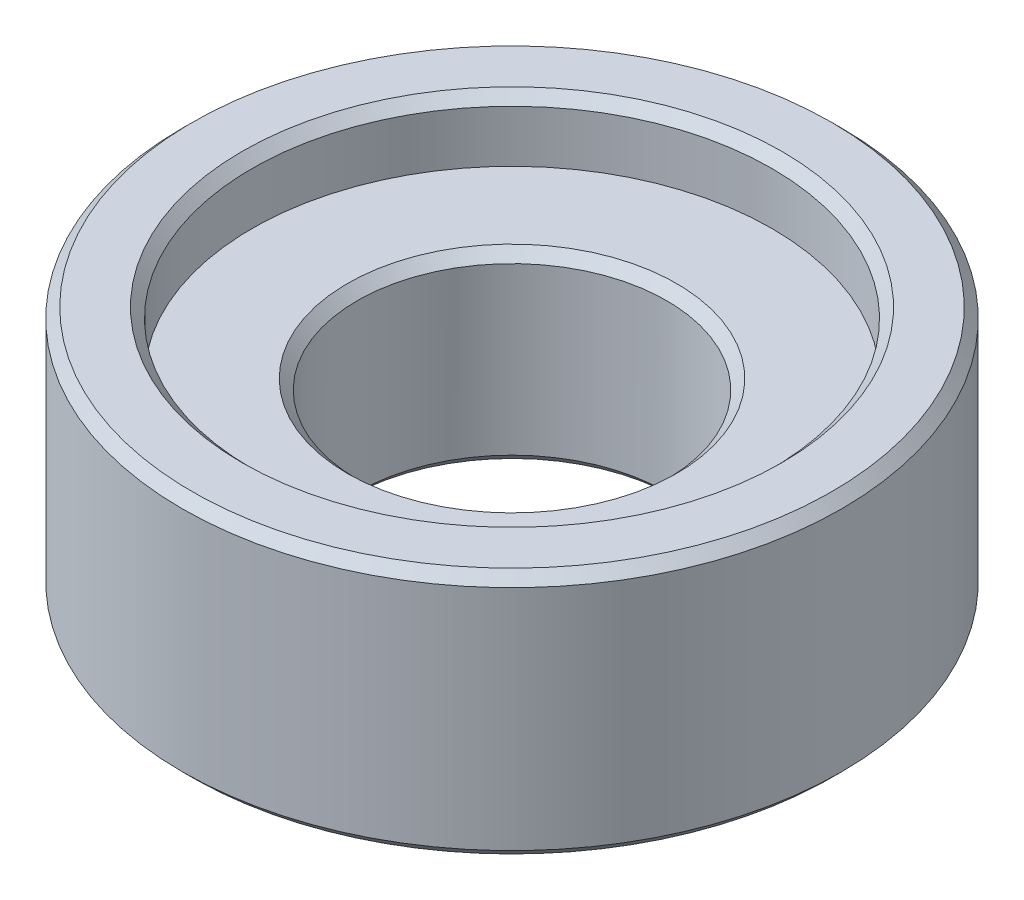
ISO-10303-21;
HEADER;
FILE_DESCRIPTION(('STEP AP214'),'2;1');
FILE_NAME('part.step','',(''),(''),'','','');
FILE_SCHEMA(('AUTOMOTIVE_DESIGN { 1 0 10303 214 1 1 1 1 }'));
ENDSEC;
DATA;
#1=APPLICATION_CONTEXT('core data for automotive mechanical design processes');
#2=APPLICATION_PROTOCOL_DEFINITION('international standard','automotive_design',2000,#1);
#3=PRODUCT_CONTEXT('',#1,'mechanical');
#4=PRODUCT('Part','Part','',(#3));
#5=PRODUCT_RELATED_PRODUCT_CATEGORY('part','',(#4));
#6=PRODUCT_DEFINITION_FORMATION('','',#4);
#7=PRODUCT_DEFINITION_CONTEXT('part definition',#1,'design');
#8=PRODUCT_DEFINITION('design','',#6,#7);
#9=PRODUCT_DEFINITION_SHAPE('','',#8);
#10=(LENGTH_UNIT() NAMED_UNIT(*) SI_UNIT(.MILLI.,.METRE.));
#11=(NAMED_UNIT(*) PLANE_ANGLE_UNIT() SI_UNIT($,.RADIAN.));
#12=(NAMED_UNIT(*) SI_UNIT($,.STERADIAN.) SOLID_ANGLE_UNIT());
#13=UNCERTAINTY_MEASURE_WITH_UNIT(LENGTH_MEASURE(1.E-05),#10,'distance_accuracy_value','');
#14=(GEOMETRIC_REPRESENTATION_CONTEXT(3) GLOBAL_UNCERTAINTY_ASSIGNED_CONTEXT((#13)) GLOBAL_UNIT_ASSIGNED_CONTEXT((#10,
#11,#12)) REPRESENTATION_CONTEXT('',''));
#15=CARTESIAN_POINT('',(0.,0.,0.));
#16=DIRECTION('',(0.,0.,1.));
#17=DIRECTION('',(1.,0.,0.));
#18=AXIS2_PLACEMENT_3D('',#15,#16,#17);
#19=CARTESIAN_POINT('',(0.,12.7,0.));
#20=DIRECTION('',(0.,1.,0.));
#21=DIRECTION('',(0.,0.,1.));
#22=AXIS2_PLACEMENT_3D('',#19,#20,#21);
#23=CONICAL_SURFACE('',#22,13.843,0.785398163397302);
#24=CARTESIAN_POINT('',(0.,12.192,0.));
#25=DIRECTION('',(0.,1.,0.));
#26=DIRECTION('',(0.,0.,1.));
#27=AXIS2_PLACEMENT_3D('',#24,#25,#26);
#28=CIRCLE('',#27,13.335);
#29=CARTESIAN_POINT('',(0.,12.192,13.335));
#30=VERTEX_POINT('',#29);
#31=EDGE_CURVE('E35',#30,#30,#28,.F.);
#32=ORIENTED_EDGE('',*,*,#31,.T.);
#33=EDGE_LOOP('',(#32));
#34=FACE_BOUND('',#33,.T.);
#35=CARTESIAN_POINT('',(0.,12.7,0.));
#36=DIRECTION('',(0.,1.,0.));
#37=DIRECTION('',(0.,0.,1.));
#38=AXIS2_PLACEMENT_3D('',#35,#36,#37);
#39=CIRCLE('',#38,13.843);
#40=CARTESIAN_POINT('',(0.,12.7,13.843));
#41=VERTEX_POINT('',#40);
#42=EDGE_CURVE('E20',#41,#41,#39,.F.);
#43=ORIENTED_EDGE('',*,*,#42,.F.);
#44=EDGE_LOOP('',(#43));
#45=FACE_BOUND('',#44,.T.);
#46=ADVANCED_FACE('F17',(#34,#45),#23,.F.);
#47=CARTESIAN_POINT('',(0.,12.7,0.));
#48=DIRECTION('',(0.,1.,0.));
#49=DIRECTION('',(0.,0.,1.));
#50=AXIS2_PLACEMENT_3D('',#47,#48,#49);
#51=CYLINDRICAL_SURFACE('',#50,13.335);
#52=CARTESIAN_POINT('',(0.,9.525,0.));
#53=DIRECTION('',(0.,1.,0.));
#54=DIRECTION('',(0.,0.,1.));
#55=AXIS2_PLACEMENT_3D('',#52,#53,#54);
#56=CIRCLE('',#55,13.335);
#57=CARTESIAN_POINT('',(0.,9.525,13.335));
#58=VERTEX_POINT('',#57);
#59=EDGE_CURVE('E52',#58,#58,#56,.T.);
#60=ORIENTED_EDGE('',*,*,#59,.F.);
#61=EDGE_LOOP('',(#60));
#62=FACE_BOUND('',#61,.T.);
#63=ORIENTED_EDGE('',*,*,#31,.F.);
#64=EDGE_LOOP('',(#63));
#65=FACE_BOUND('',#64,.T.);
#66=ADVANCED_FACE('F121',(#62,#65),#51,.F.);
#67=CARTESIAN_POINT('',(0.,12.7,0.));
#68=DIRECTION('',(0.,1.,0.));
#69=DIRECTION('',(0.,0.,1.));
#70=AXIS2_PLACEMENT_3D('',#67,#68,#69);
#71=PLANE('',#70);
#72=ORIENTED_EDGE('',*,*,#42,.T.);
#73=EDGE_LOOP('',(#72));
#74=FACE_BOUND('',#73,.T.);
#75=CARTESIAN_POINT('',(0.,12.7,0.));
#76=DIRECTION('',(0.,-1.,0.));
#77=DIRECTION('',(0.,0.,-1.));
#78=AXIS2_PLACEMENT_3D('',#75,#76,#77);
#79=CIRCLE('',#78,16.4084);
#80=CARTESIAN_POINT('',(0.,12.7,-16.4084));
#81=VERTEX_POINT('',#80);
#82=EDGE_CURVE('E47',#81,#81,#79,.T.);
#83=ORIENTED_EDGE('',*,*,#82,.F.);
#84=EDGE_LOOP('',(#83));
#85=FACE_BOUND('',#84,.T.);
#86=ADVANCED_FACE('F119',(#74,#85),#71,.T.);
#87=CARTESIAN_POINT('',(0.,9.525,0.));
#88=DIRECTION('',(0.,1.,0.));
#89=DIRECTION('',(0.,0.,1.));
#90=AXIS2_PLACEMENT_3D('',#87,#88,#89);
#91=PLANE('',#90);
#92=CARTESIAN_POINT('',(0.,9.52500000000004,0.));
#93=DIRECTION('',(0.,1.,0.));
#94=DIRECTION('',(0.,0.,1.));
#95=AXIS2_PLACEMENT_3D('',#92,#93,#94);
#96=CIRCLE('',#95,8.44549999999996);
#97=CARTESIAN_POINT('',(0.,9.52500000000004,8.44549999999996));
#98=VERTEX_POINT('',#97);
#99=EDGE_CURVE('E51',#98,#98,#96,.F.);
#100=ORIENTED_EDGE('',*,*,#99,.T.);
#101=EDGE_LOOP('',(#100));
#102=FACE_BOUND('',#101,.T.);
#103=ORIENTED_EDGE('',*,*,#59,.T.);
#104=EDGE_LOOP('',(#103));
#105=FACE_BOUND('',#104,.T.);
#106=ADVANCED_FACE('F79',(#102,#105),#91,.T.);
#107=CARTESIAN_POINT('',(0.,12.192,0.));
#108=DIRECTION('',(0.,-1.,0.));
#109=DIRECTION('',(0.,0.,-1.));
#110=AXIS2_PLACEMENT_3D('',#107,#108,#109);
#111=CONICAL_SURFACE('',#110,16.9164,0.785398163397302);
#112=CARTESIAN_POINT('',(0.,12.192,0.));
#113=DIRECTION('',(0.,1.,0.));
#114=DIRECTION('',(0.,0.,1.));
#115=AXIS2_PLACEMENT_3D('',#112,#113,#114);
#116=CIRCLE('',#115,16.9164);
#117=CARTESIAN_POINT('',(0.,12.192,16.9164));
#118=VERTEX_POINT('',#117);
#119=EDGE_CURVE('E70',#118,#118,#116,.F.);
#120=ORIENTED_EDGE('',*,*,#119,.F.);
#121=EDGE_LOOP('',(#120));
#122=FACE_BOUND('',#121,.T.);
#123=ORIENTED_EDGE('',*,*,#82,.T.);
#124=EDGE_LOOP('',(#123));
#125=FACE_BOUND('',#124,.T.);
#126=ADVANCED_FACE('F86',(#122,#125),#111,.T.);
#127=CARTESIAN_POINT('',(0.,9.52500000000004,0.));
#128=DIRECTION('',(0.,1.,0.));
#129=DIRECTION('',(0.,0.,1.));
#130=AXIS2_PLACEMENT_3D('',#127,#128,#129);
#131=CONICAL_SURFACE('',#130,8.44549999999996,0.7853981633973);
#132=ORIENTED_EDGE('',*,*,#99,.F.);
#133=EDGE_LOOP('',(#132));
#134=FACE_BOUND('',#133,.T.);
#135=CARTESIAN_POINT('',(0.,9.017,0.));
#136=DIRECTION('',(0.,1.,0.));
#137=DIRECTION('',(0.,0.,1.));
#138=AXIS2_PLACEMENT_3D('',#135,#136,#137);
#139=CIRCLE('',#138,7.9375);
#140=CARTESIAN_POINT('',(0.,9.017,7.9375));
#141=VERTEX_POINT('',#140);
#142=EDGE_CURVE('E67',#141,#141,#139,.F.);
#143=ORIENTED_EDGE('',*,*,#142,.T.);
#144=EDGE_LOOP('',(#143));
#145=FACE_BOUND('',#144,.T.);
#146=ADVANCED_FACE('F82',(#134,#145),#131,.F.);
#147=CARTESIAN_POINT('',(0.,0.,0.));
#148=DIRECTION('',(0.,1.,0.));
#149=DIRECTION('',(0.,0.,1.));
#150=AXIS2_PLACEMENT_3D('',#147,#148,#149);
#151=CYLINDRICAL_SURFACE('',#150,16.9164);
#152=CARTESIAN_POINT('',(0.,0.507999999956946,0.));
#153=DIRECTION('',(0.,1.,0.));
#154=DIRECTION('',(0.,0.,-1.));
#155=AXIS2_PLACEMENT_3D('',#152,#153,#154);
#156=CIRCLE('',#155,16.9163999999575);
#157=CARTESIAN_POINT('',(0.,0.507999999956945,-16.9163999999575));
#158=VERTEX_POINT('',#157);
#159=EDGE_CURVE('E62',#158,#158,#156,.F.);
#160=ORIENTED_EDGE('',*,*,#159,.F.);
#161=EDGE_LOOP('',(#160));
#162=FACE_BOUND('',#161,.T.);
#163=ORIENTED_EDGE('',*,*,#119,.T.);
#164=EDGE_LOOP('',(#163));
#165=FACE_BOUND('',#164,.T.);
#166=ADVANCED_FACE('F85',(#162,#165),#151,.T.);
#167=CARTESIAN_POINT('',(0.,0.,0.));
#168=DIRECTION('',(0.,1.,0.));
#169=DIRECTION('',(0.,0.,1.));
#170=AXIS2_PLACEMENT_3D('',#167,#168,#169);
#171=CYLINDRICAL_SURFACE('',#170,7.9375);
#172=ORIENTED_EDGE('',*,*,#142,.F.);
#173=EDGE_LOOP('',(#172));
#174=FACE_BOUND('',#173,.T.);
#175=CARTESIAN_POINT('',(0.,0.508000000000418,0.));
#176=DIRECTION('',(0.,-1.,0.));
#177=DIRECTION('',(0.,0.,-1.));
#178=AXIS2_PLACEMENT_3D('',#175,#176,#177);
#179=CIRCLE('',#178,7.93750000000042);
#180=CARTESIAN_POINT('',(0.,0.508000000000418,-7.93750000000042));
#181=VERTEX_POINT('',#180);
#182=EDGE_CURVE('E31',#181,#181,#179,.T.);
#183=ORIENTED_EDGE('',*,*,#182,.T.);
#184=EDGE_LOOP('',(#183));
#185=FACE_BOUND('',#184,.T.);
#186=ADVANCED_FACE('F90',(#174,#185),#171,.F.);
#187=CARTESIAN_POINT('',(0.,0.507999999956945,0.));
#188=DIRECTION('',(0.,1.,0.));
#189=DIRECTION('',(0.,0.,1.));
#190=AXIS2_PLACEMENT_3D('',#187,#188,#189);
#191=CONICAL_SURFACE('',#190,16.9163999999575,0.7853981633973);
#192=ORIENTED_EDGE('',*,*,#159,.T.);
#193=EDGE_LOOP('',(#192));
#194=FACE_BOUND('',#193,.T.);
#195=CARTESIAN_POINT('',(0.,-3.43149987591662E-13,0.));
#196=DIRECTION('',(0.,1.,0.));
#197=DIRECTION('',(-1.,0.,0.));
#198=AXIS2_PLACEMENT_3D('',#195,#196,#197);
#199=CIRCLE('',#198,16.4084000000003);
#200=CARTESIAN_POINT('',(-16.4084000000003,-3.43202569769097E-13,0.));
#201=VERTEX_POINT('',#200);
#202=EDGE_CURVE('E25',#201,#201,#199,.T.);
#203=ORIENTED_EDGE('',*,*,#202,.T.);
#204=EDGE_LOOP('',(#203));
#205=FACE_BOUND('',#204,.T.);
#206=ADVANCED_FACE('F93',(#194,#205),#191,.T.);
#207=CARTESIAN_POINT('',(0.,3.43583668460656E-13,0.));
#208=DIRECTION('',(0.,-1.,0.));
#209=DIRECTION('',(0.,0.,-1.));
#210=AXIS2_PLACEMENT_3D('',#207,#208,#209);
#211=CONICAL_SURFACE('',#210,8.44550000000034,0.7853981633973);
#212=ORIENTED_EDGE('',*,*,#182,.F.);
#213=EDGE_LOOP('',(#212));
#214=FACE_BOUND('',#213,.T.);
#215=CARTESIAN_POINT('',(0.,3.43475248243408E-13,0.));
#216=DIRECTION('',(0.,-1.,0.));
#217=DIRECTION('',(0.,0.,-1.));
#218=AXIS2_PLACEMENT_3D('',#215,#216,#217);
#219=CIRCLE('',#218,8.44550000000034);
#220=CARTESIAN_POINT('',(0.,3.43475248243408E-13,-8.44550000000034));
#221=VERTEX_POINT('',#220);
#222=EDGE_CURVE('E11',#221,#221,#219,.T.);
#223=ORIENTED_EDGE('',*,*,#222,.T.);
#224=EDGE_LOOP('',(#223));
#225=FACE_BOUND('',#224,.T.);
#226=ADVANCED_FACE('F97',(#214,#225),#211,.F.);
#227=CARTESIAN_POINT('',(0.,0.,0.));
#228=DIRECTION('',(0.,1.,0.));
#229=DIRECTION('',(0.,0.,1.));
#230=AXIS2_PLACEMENT_3D('',#227,#228,#229);
#231=PLANE('',#230);
#232=ORIENTED_EDGE('',*,*,#222,.F.);
#233=EDGE_LOOP('',(#232));
#234=FACE_BOUND('',#233,.T.);
#235=ORIENTED_EDGE('',*,*,#202,.F.);
#236=EDGE_LOOP('',(#235));
#237=FACE_BOUND('',#236,.T.);
#238=ADVANCED_FACE('F99',(#234,#237),#231,.F.);
#239=CLOSED_SHELL('',(#46,#66,#86,#106,#126,#146,#166,#186,#206,#226,#238));
#240=MANIFOLD_SOLID_BREP('B1',#239);
#241=ADVANCED_BREP_SHAPE_REPRESENTATION('',(#18,#240),#14);
#242=SHAPE_DEFINITION_REPRESENTATION(#9,#241);
ENDSEC;
END-ISO-10303-21;
